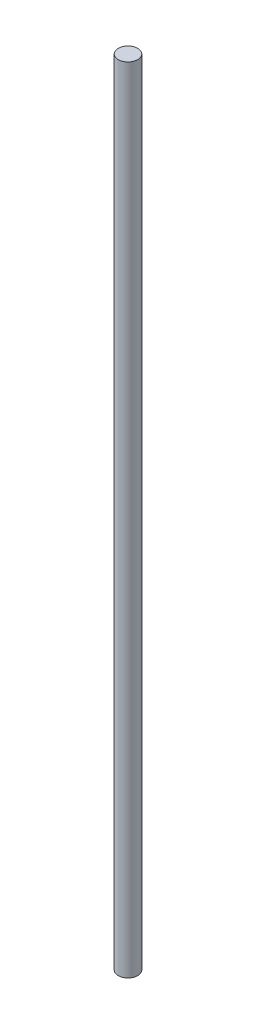
ISO-10303-21;
HEADER;
FILE_DESCRIPTION(('STEP AP214'),'2;1');
FILE_NAME('part.step','',(''),(''),'','','');
FILE_SCHEMA(('AUTOMOTIVE_DESIGN { 1 0 10303 214 1 1 1 1 }'));
ENDSEC;
DATA;
#1=APPLICATION_CONTEXT('core data for automotive mechanical design processes');
#2=APPLICATION_PROTOCOL_DEFINITION('international standard','automotive_design',2000,#1);
#3=PRODUCT_CONTEXT('',#1,'mechanical');
#4=PRODUCT('Part','Part','',(#3));
#5=PRODUCT_RELATED_PRODUCT_CATEGORY('part','',(#4));
#6=PRODUCT_DEFINITION_FORMATION('','',#4);
#7=PRODUCT_DEFINITION_CONTEXT('part definition',#1,'design');
#8=PRODUCT_DEFINITION('design','',#6,#7);
#9=PRODUCT_DEFINITION_SHAPE('','',#8);
#10=(LENGTH_UNIT() NAMED_UNIT(*) SI_UNIT(.MILLI.,.METRE.));
#11=(NAMED_UNIT(*) PLANE_ANGLE_UNIT() SI_UNIT($,.RADIAN.));
#12=(NAMED_UNIT(*) SI_UNIT($,.STERADIAN.) SOLID_ANGLE_UNIT());
#13=UNCERTAINTY_MEASURE_WITH_UNIT(LENGTH_MEASURE(1.E-05),#10,'distance_accuracy_value','');
#14=(GEOMETRIC_REPRESENTATION_CONTEXT(3) GLOBAL_UNCERTAINTY_ASSIGNED_CONTEXT((#13)) GLOBAL_UNIT_ASSIGNED_CONTEXT((#10,
#11,#12)) REPRESENTATION_CONTEXT('',''));
#15=CARTESIAN_POINT('',(0.,0.,0.));
#16=DIRECTION('',(0.,0.,1.));
#17=DIRECTION('',(1.,0.,0.));
#18=AXIS2_PLACEMENT_3D('',#15,#16,#17);
#19=CARTESIAN_POINT('',(-339.725,6627.26200000001,2827.35040000001));
#20=DIRECTION('',(0.,1.,0.));
#21=DIRECTION('',(0.,0.,1.));
#22=AXIS2_PLACEMENT_3D('',#19,#20,#21);
#23=PLANE('',#22);
#24=CARTESIAN_POINT('',(-339.725,6627.26200000001,2827.35040000001));
#25=DIRECTION('',(0.,1.,0.));
#26=DIRECTION('',(0.,0.,1.));
#27=AXIS2_PLACEMENT_3D('',#24,#25,#26);
#28=CIRCLE('',#27,4.00000000000005);
#29=CARTESIAN_POINT('',(-339.725,6627.26200000001,2831.35040000001));
#30=VERTEX_POINT('',#29);
#31=EDGE_CURVE('E17',#30,#30,#28,.F.);
#32=ORIENTED_EDGE('',*,*,#31,.F.);
#33=EDGE_LOOP('',(#32));
#34=FACE_BOUND('',#33,.T.);
#35=ADVANCED_FACE('F14',(#34),#23,.T.);
#36=CARTESIAN_POINT('',(-339.725,6302.26199999999,2827.35040000001));
#37=DIRECTION('',(0.,1.,0.));
#38=DIRECTION('',(0.,0.,1.));
#39=AXIS2_PLACEMENT_3D('',#36,#37,#38);
#40=PLANE('',#39);
#41=CARTESIAN_POINT('',(-339.725,6302.26199999999,2827.35040000001));
#42=DIRECTION('',(0.,1.,0.));
#43=DIRECTION('',(0.,0.,1.));
#44=AXIS2_PLACEMENT_3D('',#41,#42,#43);
#45=CIRCLE('',#44,4.00000000000005);
#46=CARTESIAN_POINT('',(-339.725,6302.26199999999,2831.35040000001));
#47=VERTEX_POINT('',#46);
#48=EDGE_CURVE('E10',#47,#47,#45,.T.);
#49=ORIENTED_EDGE('',*,*,#48,.F.);
#50=EDGE_LOOP('',(#49));
#51=FACE_BOUND('',#50,.T.);
#52=ADVANCED_FACE('F29',(#51),#40,.F.);
#53=CARTESIAN_POINT('',(-339.725,6302.26199999999,2827.35040000001));
#54=DIRECTION('',(0.,1.,0.));
#55=DIRECTION('',(0.,0.,1.));
#56=AXIS2_PLACEMENT_3D('',#53,#54,#55);
#57=CYLINDRICAL_SURFACE('',#56,4.00000000000005);
#58=ORIENTED_EDGE('',*,*,#48,.T.);
#59=EDGE_LOOP('',(#58));
#60=FACE_BOUND('',#59,.T.);
#61=ORIENTED_EDGE('',*,*,#31,.T.);
#62=EDGE_LOOP('',(#61));
#63=FACE_BOUND('',#62,.T.);
#64=ADVANCED_FACE('F26',(#60,#63),#57,.T.);
#65=CLOSED_SHELL('',(#35,#52,#64));
#66=MANIFOLD_SOLID_BREP('B1',#65);
#67=ADVANCED_BREP_SHAPE_REPRESENTATION('',(#18,#66),#14);
#68=SHAPE_DEFINITION_REPRESENTATION(#9,#67);
ENDSEC;
END-ISO-10303-21;
